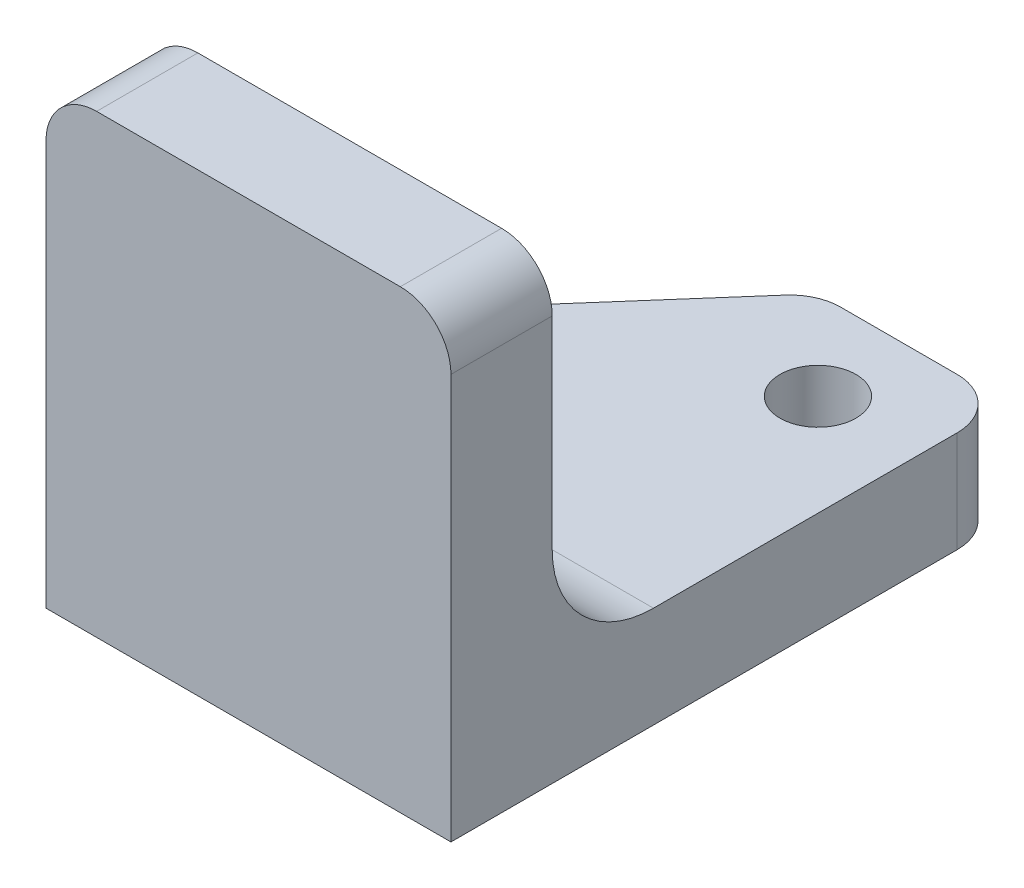
ISO-10303-21;
HEADER;
FILE_DESCRIPTION(('STEP AP214'),'2;1');
FILE_NAME('part.step','',(''),(''),'','','');
FILE_SCHEMA(('AUTOMOTIVE_DESIGN { 1 0 10303 214 1 1 1 1 }'));
ENDSEC;
DATA;
#1=APPLICATION_CONTEXT('core data for automotive mechanical design processes');
#2=APPLICATION_PROTOCOL_DEFINITION('international standard','automotive_design',2000,#1);
#3=PRODUCT_CONTEXT('',#1,'mechanical');
#4=PRODUCT('Part','Part','',(#3));
#5=PRODUCT_RELATED_PRODUCT_CATEGORY('part','',(#4));
#6=PRODUCT_DEFINITION_FORMATION('','',#4);
#7=PRODUCT_DEFINITION_CONTEXT('part definition',#1,'design');
#8=PRODUCT_DEFINITION('design','',#6,#7);
#9=PRODUCT_DEFINITION_SHAPE('','',#8);
#10=(LENGTH_UNIT() NAMED_UNIT(*) SI_UNIT(.MILLI.,.METRE.));
#11=(NAMED_UNIT(*) PLANE_ANGLE_UNIT() SI_UNIT($,.RADIAN.));
#12=(NAMED_UNIT(*) SI_UNIT($,.STERADIAN.) SOLID_ANGLE_UNIT());
#13=UNCERTAINTY_MEASURE_WITH_UNIT(LENGTH_MEASURE(1.E-05),#10,'distance_accuracy_value','');
#14=(GEOMETRIC_REPRESENTATION_CONTEXT(3) GLOBAL_UNCERTAINTY_ASSIGNED_CONTEXT((#13)) GLOBAL_UNIT_ASSIGNED_CONTEXT((#10,
#11,#12)) REPRESENTATION_CONTEXT('',''));
#15=CARTESIAN_POINT('',(0.,0.,0.));
#16=DIRECTION('',(0.,0.,1.));
#17=DIRECTION('',(1.,0.,0.));
#18=AXIS2_PLACEMENT_3D('',#15,#16,#17);
#19=CARTESIAN_POINT('',(2.,16.,4.));
#20=DIRECTION('',(0.,0.,-1.));
#21=DIRECTION('',(-1.,0.,0.));
#22=AXIS2_PLACEMENT_3D('',#19,#20,#21);
#23=CYLINDRICAL_SURFACE('',#22,2.);
#24=CARTESIAN_POINT('',(2.,16.,0.));
#25=DIRECTION('',(0.,0.,1.));
#26=DIRECTION('',(-1.,0.,0.));
#27=AXIS2_PLACEMENT_3D('',#24,#25,#26);
#28=CIRCLE('',#27,2.);
#29=CARTESIAN_POINT('',(2.00000000000001,18.,0.));
#30=VERTEX_POINT('',#29);
#31=CARTESIAN_POINT('',(0.,16.,0.));
#32=VERTEX_POINT('',#31);
#33=EDGE_CURVE('E153',#30,#32,#28,.T.);
#34=ORIENTED_EDGE('',*,*,#33,.T.);
#35=DIRECTION('',(0.,0.,-1.));
#36=VECTOR('',#35,1.);
#37=CARTESIAN_POINT('',(0.,16.,4.));
#38=LINE('',#37,#36);
#39=CARTESIAN_POINT('',(0.,16.,4.));
#40=VERTEX_POINT('',#39);
#41=EDGE_CURVE('E134',#40,#32,#38,.T.);
#42=ORIENTED_EDGE('',*,*,#41,.F.);
#43=CARTESIAN_POINT('',(2.,16.,4.));
#44=DIRECTION('',(0.,0.,1.));
#45=DIRECTION('',(-1.,0.,0.));
#46=AXIS2_PLACEMENT_3D('',#43,#44,#45);
#47=CIRCLE('',#46,2.);
#48=CARTESIAN_POINT('',(2.00000000000001,18.,4.));
#49=VERTEX_POINT('',#48);
#50=EDGE_CURVE('E141',#49,#40,#47,.T.);
#51=ORIENTED_EDGE('',*,*,#50,.F.);
#52=DIRECTION('',(0.,0.,-1.));
#53=VECTOR('',#52,1.);
#54=CARTESIAN_POINT('',(2.00000000000001,18.,4.));
#55=LINE('',#54,#53);
#56=EDGE_CURVE('E215',#49,#30,#55,.T.);
#57=ORIENTED_EDGE('',*,*,#56,.T.);
#58=EDGE_LOOP('',(#34,#42,#51,#57));
#59=FACE_BOUND('',#58,.T.);
#60=ADVANCED_FACE('F33',(#59),#23,.T.);
#61=CARTESIAN_POINT('',(0.,0.,4.));
#62=DIRECTION('',(1.,0.,0.));
#63=DIRECTION('',(0.,0.,-1.));
#64=AXIS2_PLACEMENT_3D('',#61,#62,#63);
#65=PLANE('',#64);
#66=DIRECTION('',(0.,0.,1.));
#67=VECTOR('',#66,1.);
#68=CARTESIAN_POINT('',(0.,4.,0.));
#69=LINE('',#68,#67);
#70=CARTESIAN_POINT('',(0.,4.,-7.54857477291478));
#71=VERTEX_POINT('',#70);
#72=CARTESIAN_POINT('',(0.,4.,-4.));
#73=VERTEX_POINT('',#72);
#74=EDGE_CURVE('E192',#71,#73,#69,.T.);
#75=ORIENTED_EDGE('',*,*,#74,.F.);
#76=DIRECTION('',(0.,1.,0.));
#77=VECTOR('',#76,1.);
#78=CARTESIAN_POINT('',(0.,0.,-7.54857477291478));
#79=LINE('',#78,#77);
#80=CARTESIAN_POINT('',(0.,0.,-7.54857477291478));
#81=VERTEX_POINT('',#80);
#82=EDGE_CURVE('E236',#71,#81,#79,.F.);
#83=ORIENTED_EDGE('',*,*,#82,.T.);
#84=DIRECTION('',(0.,0.,-1.));
#85=VECTOR('',#84,1.);
#86=CARTESIAN_POINT('',(0.,0.,4.));
#87=LINE('',#86,#85);
#88=CARTESIAN_POINT('',(0.,0.,4.));
#89=VERTEX_POINT('',#88);
#90=EDGE_CURVE('E137',#89,#81,#87,.T.);
#91=ORIENTED_EDGE('',*,*,#90,.F.);
#92=DIRECTION('',(0.,-1.,0.));
#93=VECTOR('',#92,1.);
#94=CARTESIAN_POINT('',(0.,0.,4.));
#95=LINE('',#94,#93);
#96=EDGE_CURVE('E128',#40,#89,#95,.T.);
#97=ORIENTED_EDGE('',*,*,#96,.F.);
#98=ORIENTED_EDGE('',*,*,#41,.T.);
#99=DIRECTION('',(0.,-1.,0.));
#100=VECTOR('',#99,1.);
#101=CARTESIAN_POINT('',(0.,0.,0.));
#102=LINE('',#101,#100);
#103=CARTESIAN_POINT('',(0.,8.,0.));
#104=VERTEX_POINT('',#103);
#105=EDGE_CURVE('E163',#32,#104,#102,.T.);
#106=ORIENTED_EDGE('',*,*,#105,.T.);
#107=CARTESIAN_POINT('',(0.,8.,-4.));
#108=DIRECTION('',(1.,0.,0.));
#109=DIRECTION('',(0.,0.,-1.));
#110=AXIS2_PLACEMENT_3D('',#107,#108,#109);
#111=CIRCLE('',#110,4.);
#112=EDGE_CURVE('E183',#104,#73,#111,.T.);
#113=ORIENTED_EDGE('',*,*,#112,.T.);
#114=EDGE_LOOP('',(#75,#83,#91,#97,#98,#106,#113));
#115=FACE_BOUND('',#114,.T.);
#116=ADVANCED_FACE('F131',(#115),#65,.F.);
#117=CARTESIAN_POINT('',(0.,0.,4.));
#118=DIRECTION('',(0.,1.,0.));
#119=DIRECTION('',(-1.,0.,0.));
#120=AXIS2_PLACEMENT_3D('',#117,#118,#119);
#121=PLANE('',#120);
#122=CARTESIAN_POINT('',(5.06194690265482,0.,-6.570796460177));
#123=DIRECTION('',(0.,1.,0.));
#124=DIRECTION('',(-1.,0.,0.));
#125=AXIS2_PLACEMENT_3D('',#122,#123,#124);
#126=CIRCLE('',#125,1.49999999999999);
#127=CARTESIAN_POINT('',(3.56194690265484,0.,-6.570796460177));
#128=VERTEX_POINT('',#127);
#129=EDGE_CURVE('E262',#128,#128,#126,.T.);
#130=ORIENTED_EDGE('',*,*,#129,.T.);
#131=EDGE_LOOP('',(#130));
#132=FACE_BOUND('',#131,.T.);
#133=CARTESIAN_POINT('',(12.,0.,-14.5000000000001));
#134=DIRECTION('',(0.,1.,0.));
#135=DIRECTION('',(-1.,0.,0.));
#136=AXIS2_PLACEMENT_3D('',#133,#134,#135);
#137=CIRCLE('',#136,1.49999999999999);
#138=CARTESIAN_POINT('',(10.5,0.,-14.5000000000001));
#139=VERTEX_POINT('',#138);
#140=EDGE_CURVE('E208',#139,#139,#137,.T.);
#141=ORIENTED_EDGE('',*,*,#140,.T.);
#142=EDGE_LOOP('',(#141));
#143=FACE_BOUND('',#142,.T.);
#144=ORIENTED_EDGE('',*,*,#90,.T.);
#145=CARTESIAN_POINT('',(2.,0.,-7.54857477291478));
#146=DIRECTION('',(0.,1.,0.));
#147=DIRECTION('',(-1.,0.,0.));
#148=AXIS2_PLACEMENT_3D('',#145,#146,#147);
#149=CIRCLE('',#148,2.);
#150=CARTESIAN_POINT('',(0.494846610586242,0.,-8.86558398865181));
#151=VERTEX_POINT('',#150);
#152=EDGE_CURVE('E242',#81,#151,#149,.F.);
#153=ORIENTED_EDGE('',*,*,#152,.T.);
#154=DIRECTION('',(0.658504607868517,0.,-0.752576694706879));
#155=VECTOR('',#154,1.);
#156=CARTESIAN_POINT('',(-6.09559752466355,0.,-1.3336478340806));
#157=LINE('',#156,#155);
#158=CARTESIAN_POINT('',(7.88984368428579,0.,-17.317009215737));
#159=VERTEX_POINT('',#158);
#160=EDGE_CURVE('E254',#151,#159,#157,.T.);
#161=ORIENTED_EDGE('',*,*,#160,.T.);
#162=CARTESIAN_POINT('',(9.39499707369955,0.,-16.));
#163=DIRECTION('',(0.,1.,0.));
#164=DIRECTION('',(-1.,0.,0.));
#165=AXIS2_PLACEMENT_3D('',#162,#163,#164);
#166=CIRCLE('',#165,2.);
#167=CARTESIAN_POINT('',(9.39499707369955,0.,-18.));
#168=VERTEX_POINT('',#167);
#169=EDGE_CURVE('E54',#159,#168,#166,.F.);
#170=ORIENTED_EDGE('',*,*,#169,.T.);
#171=DIRECTION('',(-1.,0.,0.));
#172=VECTOR('',#171,1.);
#173=CARTESIAN_POINT('',(0.,0.,-18.));
#174=LINE('',#173,#172);
#175=CARTESIAN_POINT('',(14.,0.,-18.));
#176=VERTEX_POINT('',#175);
#177=EDGE_CURVE('E195',#176,#168,#174,.T.);
#178=ORIENTED_EDGE('',*,*,#177,.F.);
#179=CARTESIAN_POINT('',(14.,0.,-16.));
#180=DIRECTION('',(0.,1.,0.));
#181=DIRECTION('',(-1.,0.,0.));
#182=AXIS2_PLACEMENT_3D('',#179,#180,#181);
#183=CIRCLE('',#182,2.);
#184=CARTESIAN_POINT('',(16.,0.,-16.));
#185=VERTEX_POINT('',#184);
#186=EDGE_CURVE('E48',#176,#185,#183,.F.);
#187=ORIENTED_EDGE('',*,*,#186,.T.);
#188=DIRECTION('',(0.,0.,-1.));
#189=VECTOR('',#188,1.);
#190=CARTESIAN_POINT('',(16.,0.,4.));
#191=LINE('',#190,#189);
#192=CARTESIAN_POINT('',(16.,0.,4.));
#193=VERTEX_POINT('',#192);
#194=EDGE_CURVE('E159',#193,#185,#191,.T.);
#195=ORIENTED_EDGE('',*,*,#194,.F.);
#196=DIRECTION('',(1.,0.,0.));
#197=VECTOR('',#196,1.);
#198=CARTESIAN_POINT('',(0.,0.,4.));
#199=LINE('',#198,#197);
#200=EDGE_CURVE('E140',#89,#193,#199,.T.);
#201=ORIENTED_EDGE('',*,*,#200,.F.);
#202=EDGE_LOOP('',(#144,#153,#161,#170,#178,#187,#195,#201));
#203=FACE_BOUND('',#202,.T.);
#204=ADVANCED_FACE('F257',(#132,#143,#203),#121,.F.);
#205=CARTESIAN_POINT('',(16.,0.,4.));
#206=DIRECTION('',(-1.,0.,0.));
#207=DIRECTION('',(0.,0.,1.));
#208=AXIS2_PLACEMENT_3D('',#205,#206,#207);
#209=PLANE('',#208);
#210=ORIENTED_EDGE('',*,*,#194,.T.);
#211=DIRECTION('',(0.,-1.,0.));
#212=VECTOR('',#211,1.);
#213=CARTESIAN_POINT('',(16.,0.,-16.));
#214=LINE('',#213,#212);
#215=CARTESIAN_POINT('',(16.,4.,-16.));
#216=VERTEX_POINT('',#215);
#217=EDGE_CURVE('E11',#185,#216,#214,.F.);
#218=ORIENTED_EDGE('',*,*,#217,.T.);
#219=DIRECTION('',(0.,0.,-1.));
#220=VECTOR('',#219,1.);
#221=CARTESIAN_POINT('',(16.,4.,0.));
#222=LINE('',#221,#220);
#223=CARTESIAN_POINT('',(16.,4.,-4.));
#224=VERTEX_POINT('',#223);
#225=EDGE_CURVE('E194',#224,#216,#222,.T.);
#226=ORIENTED_EDGE('',*,*,#225,.F.);
#227=CARTESIAN_POINT('',(16.,8.,-4.));
#228=DIRECTION('',(-1.,0.,0.));
#229=DIRECTION('',(0.,0.,1.));
#230=AXIS2_PLACEMENT_3D('',#227,#228,#229);
#231=CIRCLE('',#230,4.);
#232=CARTESIAN_POINT('',(16.,8.,0.));
#233=VERTEX_POINT('',#232);
#234=EDGE_CURVE('E181',#224,#233,#231,.T.);
#235=ORIENTED_EDGE('',*,*,#234,.T.);
#236=DIRECTION('',(0.,1.,0.));
#237=VECTOR('',#236,1.);
#238=CARTESIAN_POINT('',(16.,0.,0.));
#239=LINE('',#238,#237);
#240=CARTESIAN_POINT('',(16.,16.,0.));
#241=VERTEX_POINT('',#240);
#242=EDGE_CURVE('E166',#233,#241,#239,.T.);
#243=ORIENTED_EDGE('',*,*,#242,.T.);
#244=DIRECTION('',(0.,0.,-1.));
#245=VECTOR('',#244,1.);
#246=CARTESIAN_POINT('',(16.,16.,4.));
#247=LINE('',#246,#245);
#248=CARTESIAN_POINT('',(16.,16.,4.));
#249=VERTEX_POINT('',#248);
#250=EDGE_CURVE('E219',#249,#241,#247,.T.);
#251=ORIENTED_EDGE('',*,*,#250,.F.);
#252=DIRECTION('',(0.,1.,0.));
#253=VECTOR('',#252,1.);
#254=CARTESIAN_POINT('',(16.,0.,4.));
#255=LINE('',#254,#253);
#256=EDGE_CURVE('E212',#193,#249,#255,.T.);
#257=ORIENTED_EDGE('',*,*,#256,.F.);
#258=EDGE_LOOP('',(#210,#218,#226,#235,#243,#251,#257));
#259=FACE_BOUND('',#258,.T.);
#260=ADVANCED_FACE('F226',(#259),#209,.F.);
#261=CARTESIAN_POINT('',(14.,16.,4.));
#262=DIRECTION('',(0.,0.,-1.));
#263=DIRECTION('',(-1.,0.,0.));
#264=AXIS2_PLACEMENT_3D('',#261,#262,#263);
#265=CYLINDRICAL_SURFACE('',#264,2.);
#266=CARTESIAN_POINT('',(14.,16.,0.));
#267=DIRECTION('',(0.,0.,1.));
#268=DIRECTION('',(-1.,0.,0.));
#269=AXIS2_PLACEMENT_3D('',#266,#267,#268);
#270=CIRCLE('',#269,2.);
#271=CARTESIAN_POINT('',(14.,18.,0.));
#272=VERTEX_POINT('',#271);
#273=EDGE_CURVE('E175',#241,#272,#270,.T.);
#274=ORIENTED_EDGE('',*,*,#273,.T.);
#275=DIRECTION('',(0.,0.,-1.));
#276=VECTOR('',#275,1.);
#277=CARTESIAN_POINT('',(14.,18.,4.));
#278=LINE('',#277,#276);
#279=CARTESIAN_POINT('',(14.,18.,4.));
#280=VERTEX_POINT('',#279);
#281=EDGE_CURVE('E216',#280,#272,#278,.T.);
#282=ORIENTED_EDGE('',*,*,#281,.F.);
#283=CARTESIAN_POINT('',(14.,16.,4.));
#284=DIRECTION('',(0.,0.,1.));
#285=DIRECTION('',(-1.,0.,0.));
#286=AXIS2_PLACEMENT_3D('',#283,#284,#285);
#287=CIRCLE('',#286,2.);
#288=EDGE_CURVE('E214',#249,#280,#287,.T.);
#289=ORIENTED_EDGE('',*,*,#288,.F.);
#290=ORIENTED_EDGE('',*,*,#250,.T.);
#291=EDGE_LOOP('',(#274,#282,#289,#290));
#292=FACE_BOUND('',#291,.T.);
#293=ADVANCED_FACE('F349',(#292),#265,.T.);
#294=CARTESIAN_POINT('',(2.00000000000001,18.,4.));
#295=DIRECTION('',(0.,-1.,0.));
#296=DIRECTION('',(0.,0.,-1.));
#297=AXIS2_PLACEMENT_3D('',#294,#295,#296);
#298=PLANE('',#297);
#299=DIRECTION('',(-1.,0.,0.));
#300=VECTOR('',#299,1.);
#301=CARTESIAN_POINT('',(2.00000000000001,18.,0.));
#302=LINE('',#301,#300);
#303=EDGE_CURVE('E150',#272,#30,#302,.T.);
#304=ORIENTED_EDGE('',*,*,#303,.T.);
#305=ORIENTED_EDGE('',*,*,#56,.F.);
#306=DIRECTION('',(-1.,0.,0.));
#307=VECTOR('',#306,1.);
#308=CARTESIAN_POINT('',(2.00000000000001,18.,4.));
#309=LINE('',#308,#307);
#310=EDGE_CURVE('E146',#280,#49,#309,.T.);
#311=ORIENTED_EDGE('',*,*,#310,.F.);
#312=ORIENTED_EDGE('',*,*,#281,.T.);
#313=EDGE_LOOP('',(#304,#305,#311,#312));
#314=FACE_BOUND('',#313,.T.);
#315=ADVANCED_FACE('F390',(#314),#298,.F.);
#316=CARTESIAN_POINT('',(2.,16.,4.));
#317=DIRECTION('',(0.,0.,-1.));
#318=DIRECTION('',(-1.,0.,0.));
#319=AXIS2_PLACEMENT_3D('',#316,#317,#318);
#320=PLANE('',#319);
#321=ORIENTED_EDGE('',*,*,#50,.T.);
#322=ORIENTED_EDGE('',*,*,#96,.T.);
#323=ORIENTED_EDGE('',*,*,#200,.T.);
#324=ORIENTED_EDGE('',*,*,#256,.T.);
#325=ORIENTED_EDGE('',*,*,#288,.T.);
#326=ORIENTED_EDGE('',*,*,#310,.T.);
#327=EDGE_LOOP('',(#321,#322,#323,#324,#325,#326));
#328=FACE_BOUND('',#327,.T.);
#329=ADVANCED_FACE('F144',(#328),#320,.F.);
#330=CARTESIAN_POINT('',(2.,16.,0.));
#331=DIRECTION('',(0.,0.,-1.));
#332=DIRECTION('',(-1.,0.,0.));
#333=AXIS2_PLACEMENT_3D('',#330,#331,#332);
#334=PLANE('',#333);
#335=ORIENTED_EDGE('',*,*,#242,.F.);
#336=DIRECTION('',(1.,0.,0.));
#337=VECTOR('',#336,1.);
#338=CARTESIAN_POINT('',(2.,8.,0.));
#339=LINE('',#338,#337);
#340=EDGE_CURVE('E157',#233,#104,#339,.F.);
#341=ORIENTED_EDGE('',*,*,#340,.T.);
#342=ORIENTED_EDGE('',*,*,#105,.F.);
#343=ORIENTED_EDGE('',*,*,#33,.F.);
#344=ORIENTED_EDGE('',*,*,#303,.F.);
#345=ORIENTED_EDGE('',*,*,#273,.F.);
#346=EDGE_LOOP('',(#335,#341,#342,#343,#344,#345));
#347=FACE_BOUND('',#346,.T.);
#348=ADVANCED_FACE('F341',(#347),#334,.T.);
#349=CARTESIAN_POINT('',(0.,4.,-18.));
#350=DIRECTION('',(0.,0.,1.));
#351=DIRECTION('',(1.,0.,0.));
#352=AXIS2_PLACEMENT_3D('',#349,#350,#351);
#353=PLANE('',#352);
#354=ORIENTED_EDGE('',*,*,#177,.T.);
#355=DIRECTION('',(0.,1.,0.));
#356=VECTOR('',#355,1.);
#357=CARTESIAN_POINT('',(9.39499707369955,4.,-18.));
#358=LINE('',#357,#356);
#359=CARTESIAN_POINT('',(9.39499707369955,4.,-18.));
#360=VERTEX_POINT('',#359);
#361=EDGE_CURVE('E41',#168,#360,#358,.T.);
#362=ORIENTED_EDGE('',*,*,#361,.T.);
#363=DIRECTION('',(-1.,0.,0.));
#364=VECTOR('',#363,1.);
#365=CARTESIAN_POINT('',(0.,4.,-18.));
#366=LINE('',#365,#364);
#367=CARTESIAN_POINT('',(14.,4.,-18.));
#368=VERTEX_POINT('',#367);
#369=EDGE_CURVE('E199',#368,#360,#366,.T.);
#370=ORIENTED_EDGE('',*,*,#369,.F.);
#371=DIRECTION('',(0.,-1.,0.));
#372=VECTOR('',#371,1.);
#373=CARTESIAN_POINT('',(14.,4.,-18.));
#374=LINE('',#373,#372);
#375=EDGE_CURVE('E231',#368,#176,#374,.T.);
#376=ORIENTED_EDGE('',*,*,#375,.T.);
#377=EDGE_LOOP('',(#354,#362,#370,#376));
#378=FACE_BOUND('',#377,.T.);
#379=ADVANCED_FACE('F247',(#378),#353,.F.);
#380=CARTESIAN_POINT('',(0.,4.,0.));
#381=DIRECTION('',(0.,-1.,0.));
#382=DIRECTION('',(0.,0.,-1.));
#383=AXIS2_PLACEMENT_3D('',#380,#381,#382);
#384=PLANE('',#383);
#385=CARTESIAN_POINT('',(5.06194690265482,4.00000000000012,-6.570796460177));
#386=DIRECTION('',(0.,1.,0.));
#387=DIRECTION('',(0.,0.,1.));
#388=AXIS2_PLACEMENT_3D('',#385,#386,#387);
#389=CIRCLE('',#388,1.49999999999999);
#390=CARTESIAN_POINT('',(5.06194690265482,4.00000000000012,-5.07079646017701));
#391=VERTEX_POINT('',#390);
#392=EDGE_CURVE('E259',#391,#391,#389,.T.);
#393=ORIENTED_EDGE('',*,*,#392,.F.);
#394=EDGE_LOOP('',(#393));
#395=FACE_BOUND('',#394,.T.);
#396=CARTESIAN_POINT('',(12.,4.00000000000012,-14.5000000000001));
#397=DIRECTION('',(0.,1.,0.));
#398=DIRECTION('',(0.,0.,1.));
#399=AXIS2_PLACEMENT_3D('',#396,#397,#398);
#400=CIRCLE('',#399,1.49999999999999);
#401=CARTESIAN_POINT('',(12.,4.00000000000012,-13.0000000000001));
#402=VERTEX_POINT('',#401);
#403=EDGE_CURVE('E267',#402,#402,#400,.T.);
#404=ORIENTED_EDGE('',*,*,#403,.F.);
#405=EDGE_LOOP('',(#404));
#406=FACE_BOUND('',#405,.T.);
#407=DIRECTION('',(0.658504607868517,0.,-0.752576694706879));
#408=VECTOR('',#407,1.);
#409=CARTESIAN_POINT('',(8.48746062051589,4.,-18.));
#410=LINE('',#409,#408);
#411=CARTESIAN_POINT('',(0.49484661058624,4.,-8.86558398865181));
#412=VERTEX_POINT('',#411);
#413=CARTESIAN_POINT('',(7.8898436842858,4.,-17.317009215737));
#414=VERTEX_POINT('',#413);
#415=EDGE_CURVE('E256',#412,#414,#410,.T.);
#416=ORIENTED_EDGE('',*,*,#415,.F.);
#417=CARTESIAN_POINT('',(2.,4.,-7.54857477291478));
#418=DIRECTION('',(0.,-1.,0.));
#419=DIRECTION('',(0.,0.,-1.));
#420=AXIS2_PLACEMENT_3D('',#417,#418,#419);
#421=CIRCLE('',#420,2.);
#422=EDGE_CURVE('E233',#412,#71,#421,.F.);
#423=ORIENTED_EDGE('',*,*,#422,.T.);
#424=ORIENTED_EDGE('',*,*,#74,.T.);
#425=DIRECTION('',(1.,0.,0.));
#426=VECTOR('',#425,1.);
#427=CARTESIAN_POINT('',(0.,4.,-4.));
#428=LINE('',#427,#426);
#429=EDGE_CURVE('E154',#73,#224,#428,.T.);
#430=ORIENTED_EDGE('',*,*,#429,.T.);
#431=ORIENTED_EDGE('',*,*,#225,.T.);
#432=CARTESIAN_POINT('',(14.,4.,-16.));
#433=DIRECTION('',(0.,-1.,0.));
#434=DIRECTION('',(0.,0.,-1.));
#435=AXIS2_PLACEMENT_3D('',#432,#433,#434);
#436=CIRCLE('',#435,2.);
#437=EDGE_CURVE('E191',#216,#368,#436,.F.);
#438=ORIENTED_EDGE('',*,*,#437,.T.);
#439=ORIENTED_EDGE('',*,*,#369,.T.);
#440=CARTESIAN_POINT('',(9.39499707369955,4.,-16.));
#441=DIRECTION('',(0.,-1.,0.));
#442=DIRECTION('',(0.,0.,-1.));
#443=AXIS2_PLACEMENT_3D('',#440,#441,#442);
#444=CIRCLE('',#443,2.);
#445=EDGE_CURVE('E232',#360,#414,#444,.F.);
#446=ORIENTED_EDGE('',*,*,#445,.T.);
#447=EDGE_LOOP('',(#416,#423,#424,#430,#431,#438,#439,#446));
#448=FACE_BOUND('',#447,.T.);
#449=ADVANCED_FACE('F286',(#395,#406,#448),#384,.F.);
#450=CARTESIAN_POINT('',(0.,8.,-4.));
#451=DIRECTION('',(1.,0.,0.));
#452=DIRECTION('',(0.,0.,-1.));
#453=AXIS2_PLACEMENT_3D('',#450,#451,#452);
#454=CYLINDRICAL_SURFACE('',#453,4.);
#455=ORIENTED_EDGE('',*,*,#112,.F.);
#456=ORIENTED_EDGE('',*,*,#340,.F.);
#457=ORIENTED_EDGE('',*,*,#234,.F.);
#458=ORIENTED_EDGE('',*,*,#429,.F.);
#459=EDGE_LOOP('',(#455,#456,#457,#458));
#460=FACE_BOUND('',#459,.T.);
#461=ADVANCED_FACE('F278',(#460),#454,.F.);
#462=CARTESIAN_POINT('',(12.,4.00000000000011,-14.5000000000001));
#463=DIRECTION('',(0.,1.,0.));
#464=DIRECTION('',(0.,0.,1.));
#465=AXIS2_PLACEMENT_3D('',#462,#463,#464);
#466=CYLINDRICAL_SURFACE('',#465,1.49999999999999);
#467=ORIENTED_EDGE('',*,*,#403,.T.);
#468=EDGE_LOOP('',(#467));
#469=FACE_BOUND('',#468,.T.);
#470=ORIENTED_EDGE('',*,*,#140,.F.);
#471=EDGE_LOOP('',(#470));
#472=FACE_BOUND('',#471,.T.);
#473=ADVANCED_FACE('F275',(#469,#472),#466,.F.);
#474=CARTESIAN_POINT('',(5.06194690265482,4.00000000000011,-6.570796460177));
#475=DIRECTION('',(0.,1.,0.));
#476=DIRECTION('',(0.,0.,1.));
#477=AXIS2_PLACEMENT_3D('',#474,#475,#476);
#478=CYLINDRICAL_SURFACE('',#477,1.49999999999999);
#479=ORIENTED_EDGE('',*,*,#392,.T.);
#480=EDGE_LOOP('',(#479));
#481=FACE_BOUND('',#480,.T.);
#482=ORIENTED_EDGE('',*,*,#129,.F.);
#483=EDGE_LOOP('',(#482));
#484=FACE_BOUND('',#483,.T.);
#485=ADVANCED_FACE('F277',(#481,#484),#478,.F.);
#486=CARTESIAN_POINT('',(8.48746062051589,-6.,-18.));
#487=DIRECTION('',(0.752576694706879,0.,0.658504607868517));
#488=DIRECTION('',(0.658504607868517,0.,-0.752576694706879));
#489=AXIS2_PLACEMENT_3D('',#486,#487,#488);
#490=PLANE('',#489);
#491=ORIENTED_EDGE('',*,*,#160,.F.);
#492=DIRECTION('',(0.,1.,0.));
#493=VECTOR('',#492,1.);
#494=CARTESIAN_POINT('',(0.494846610586241,-6.,-8.86558398865181));
#495=LINE('',#494,#493);
#496=EDGE_CURVE('E188',#151,#412,#495,.T.);
#497=ORIENTED_EDGE('',*,*,#496,.T.);
#498=ORIENTED_EDGE('',*,*,#415,.T.);
#499=DIRECTION('',(0.,1.,0.));
#500=VECTOR('',#499,1.);
#501=CARTESIAN_POINT('',(7.8898436842858,-6.,-17.317009215737));
#502=LINE('',#501,#500);
#503=EDGE_CURVE('E186',#414,#159,#502,.F.);
#504=ORIENTED_EDGE('',*,*,#503,.T.);
#505=EDGE_LOOP('',(#491,#497,#498,#504));
#506=FACE_BOUND('',#505,.T.);
#507=ADVANCED_FACE('F253',(#506),#490,.F.);
#508=CARTESIAN_POINT('',(2.,-6.,-7.54857477291478));
#509=DIRECTION('',(0.,1.,0.));
#510=DIRECTION('',(0.,0.,1.));
#511=AXIS2_PLACEMENT_3D('',#508,#509,#510);
#512=CYLINDRICAL_SURFACE('',#511,2.);
#513=ORIENTED_EDGE('',*,*,#152,.F.);
#514=ORIENTED_EDGE('',*,*,#82,.F.);
#515=ORIENTED_EDGE('',*,*,#422,.F.);
#516=ORIENTED_EDGE('',*,*,#496,.F.);
#517=EDGE_LOOP('',(#513,#514,#515,#516));
#518=FACE_BOUND('',#517,.T.);
#519=ADVANCED_FACE('F299',(#518),#512,.T.);
#520=CARTESIAN_POINT('',(9.39499707369955,4.,-16.));
#521=DIRECTION('',(0.,1.,0.));
#522=DIRECTION('',(0.,0.,1.));
#523=AXIS2_PLACEMENT_3D('',#520,#521,#522);
#524=CYLINDRICAL_SURFACE('',#523,2.);
#525=ORIENTED_EDGE('',*,*,#169,.F.);
#526=ORIENTED_EDGE('',*,*,#503,.F.);
#527=ORIENTED_EDGE('',*,*,#445,.F.);
#528=ORIENTED_EDGE('',*,*,#361,.F.);
#529=EDGE_LOOP('',(#525,#526,#527,#528));
#530=FACE_BOUND('',#529,.T.);
#531=ADVANCED_FACE('F249',(#530),#524,.T.);
#532=CARTESIAN_POINT('',(14.,4.,-16.));
#533=DIRECTION('',(0.,-1.,0.));
#534=DIRECTION('',(0.,0.,-1.));
#535=AXIS2_PLACEMENT_3D('',#532,#533,#534);
#536=CYLINDRICAL_SURFACE('',#535,2.);
#537=ORIENTED_EDGE('',*,*,#437,.F.);
#538=ORIENTED_EDGE('',*,*,#217,.F.);
#539=ORIENTED_EDGE('',*,*,#186,.F.);
#540=ORIENTED_EDGE('',*,*,#375,.F.);
#541=EDGE_LOOP('',(#537,#538,#539,#540));
#542=FACE_BOUND('',#541,.T.);
#543=ADVANCED_FACE('F35',(#542),#536,.T.);
#544=CLOSED_SHELL('',(#60,#116,#204,#260,#293,#315,#329,#348,#379,#449,#461,#473,#485,#507,#519,
#531,#543));
#545=MANIFOLD_SOLID_BREP('B2',#544);
#546=ADVANCED_BREP_SHAPE_REPRESENTATION('',(#18,#545),#14);
#547=SHAPE_DEFINITION_REPRESENTATION(#9,#546);
ENDSEC;
END-ISO-10303-21;
